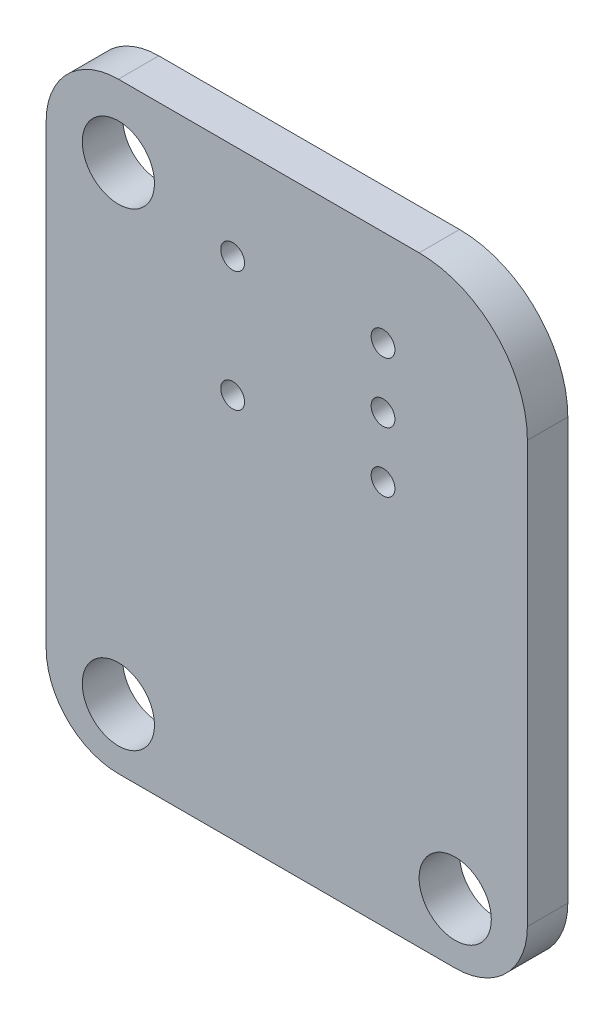
ISO-10303-21;
HEADER;
FILE_DESCRIPTION(('STEP AP214'),'2;1');
FILE_NAME('part.step','',(''),(''),'','','');
FILE_SCHEMA(('AUTOMOTIVE_DESIGN { 1 0 10303 214 1 1 1 1 }'));
ENDSEC;
DATA;
#1=APPLICATION_CONTEXT('core data for automotive mechanical design processes');
#2=APPLICATION_PROTOCOL_DEFINITION('international standard','automotive_design',2000,#1);
#3=PRODUCT_CONTEXT('',#1,'mechanical');
#4=PRODUCT('Part','Part','',(#3));
#5=PRODUCT_RELATED_PRODUCT_CATEGORY('part','',(#4));
#6=PRODUCT_DEFINITION_FORMATION('','',#4);
#7=PRODUCT_DEFINITION_CONTEXT('part definition',#1,'design');
#8=PRODUCT_DEFINITION('design','',#6,#7);
#9=PRODUCT_DEFINITION_SHAPE('','',#8);
#10=(LENGTH_UNIT() NAMED_UNIT(*) SI_UNIT(.MILLI.,.METRE.));
#11=(NAMED_UNIT(*) PLANE_ANGLE_UNIT() SI_UNIT($,.RADIAN.));
#12=(NAMED_UNIT(*) SI_UNIT($,.STERADIAN.) SOLID_ANGLE_UNIT());
#13=UNCERTAINTY_MEASURE_WITH_UNIT(LENGTH_MEASURE(1.E-05),#10,'distance_accuracy_value','');
#14=(GEOMETRIC_REPRESENTATION_CONTEXT(3) GLOBAL_UNCERTAINTY_ASSIGNED_CONTEXT((#13)) GLOBAL_UNIT_ASSIGNED_CONTEXT((#10,
#11,#12)) REPRESENTATION_CONTEXT('',''));
#15=CARTESIAN_POINT('',(0.,0.,0.));
#16=DIRECTION('',(0.,0.,1.));
#17=DIRECTION('',(1.,0.,0.));
#18=AXIS2_PLACEMENT_3D('',#15,#16,#17);
#19=CARTESIAN_POINT('',(95.5,60.5,-3.02000000000003));
#20=DIRECTION('',(0.,0.,-1.));
#21=DIRECTION('',(-1.,0.,0.));
#22=AXIS2_PLACEMENT_3D('',#19,#20,#21);
#23=CYLINDRICAL_SURFACE('',#22,4.50000000000003);
#24=CARTESIAN_POINT('',(95.5,60.5,-4.70000000000003));
#25=DIRECTION('',(0.,0.,1.));
#26=DIRECTION('',(1.,0.,0.));
#27=AXIS2_PLACEMENT_3D('',#24,#25,#26);
#28=CIRCLE('',#27,4.50000000000003);
#29=CARTESIAN_POINT('',(100.,60.5,-4.70000000000003));
#30=VERTEX_POINT('',#29);
#31=CARTESIAN_POINT('',(95.5,65.,-4.70000000000003));
#32=VERTEX_POINT('',#31);
#33=EDGE_CURVE('E129',#30,#32,#28,.T.);
#34=ORIENTED_EDGE('',*,*,#33,.T.);
#35=DIRECTION('',(0.,0.,-1.));
#36=VECTOR('',#35,1.);
#37=CARTESIAN_POINT('',(95.5,65.,-3.02000000000003));
#38=LINE('',#37,#36);
#39=CARTESIAN_POINT('',(95.5,65.,-3.02000000000003));
#40=VERTEX_POINT('',#39);
#41=EDGE_CURVE('E11',#40,#32,#38,.T.);
#42=ORIENTED_EDGE('',*,*,#41,.F.);
#43=CARTESIAN_POINT('',(95.5,60.5,-3.02000000000003));
#44=DIRECTION('',(0.,0.,1.));
#45=DIRECTION('',(1.,0.,0.));
#46=AXIS2_PLACEMENT_3D('',#43,#44,#45);
#47=CIRCLE('',#46,4.50000000000003);
#48=CARTESIAN_POINT('',(100.,60.5,-3.02000000000003));
#49=VERTEX_POINT('',#48);
#50=EDGE_CURVE('E144',#49,#40,#47,.T.);
#51=ORIENTED_EDGE('',*,*,#50,.F.);
#52=DIRECTION('',(0.,0.,-1.));
#53=VECTOR('',#52,1.);
#54=CARTESIAN_POINT('',(100.,60.5,-3.02000000000003));
#55=LINE('',#54,#53);
#56=EDGE_CURVE('E125',#49,#30,#55,.T.);
#57=ORIENTED_EDGE('',*,*,#56,.T.);
#58=EDGE_LOOP('',(#34,#42,#51,#57));
#59=FACE_BOUND('',#58,.T.);
#60=ADVANCED_FACE('F33',(#59),#23,.T.);
#61=CARTESIAN_POINT('',(95.5,65.,-3.02000000000003));
#62=DIRECTION('',(0.,-1.,0.));
#63=DIRECTION('',(1.,0.,0.));
#64=AXIS2_PLACEMENT_3D('',#61,#62,#63);
#65=PLANE('',#64);
#66=DIRECTION('',(-1.,0.,0.));
#67=VECTOR('',#66,1.);
#68=CARTESIAN_POINT('',(95.5,65.,-4.70000000000003));
#69=LINE('',#68,#67);
#70=CARTESIAN_POINT('',(83.,65.,-4.70000000000003));
#71=VERTEX_POINT('',#70);
#72=EDGE_CURVE('E132',#32,#71,#69,.T.);
#73=ORIENTED_EDGE('',*,*,#72,.T.);
#74=DIRECTION('',(0.,0.,-1.));
#75=VECTOR('',#74,1.);
#76=CARTESIAN_POINT('',(83.,65.,-3.02000000000003));
#77=LINE('',#76,#75);
#78=CARTESIAN_POINT('',(83.,65.,-3.02000000000003));
#79=VERTEX_POINT('',#78);
#80=EDGE_CURVE('E41',#79,#71,#77,.T.);
#81=ORIENTED_EDGE('',*,*,#80,.F.);
#82=DIRECTION('',(-1.,0.,0.));
#83=VECTOR('',#82,1.);
#84=CARTESIAN_POINT('',(95.5,65.,-3.02000000000003));
#85=LINE('',#84,#83);
#86=EDGE_CURVE('E92',#40,#79,#85,.T.);
#87=ORIENTED_EDGE('',*,*,#86,.F.);
#88=ORIENTED_EDGE('',*,*,#41,.T.);
#89=EDGE_LOOP('',(#73,#81,#87,#88));
#90=FACE_BOUND('',#89,.T.);
#91=ADVANCED_FACE('F239',(#90),#65,.F.);
#92=CARTESIAN_POINT('',(83.,62.,-3.02000000000003));
#93=DIRECTION('',(0.,0.,-1.));
#94=DIRECTION('',(-1.,0.,0.));
#95=AXIS2_PLACEMENT_3D('',#92,#93,#94);
#96=CYLINDRICAL_SURFACE('',#95,3.00000000000001);
#97=CARTESIAN_POINT('',(83.,62.,-4.70000000000003));
#98=DIRECTION('',(0.,0.,1.));
#99=DIRECTION('',(1.,0.,0.));
#100=AXIS2_PLACEMENT_3D('',#97,#98,#99);
#101=CIRCLE('',#100,3.00000000000001);
#102=CARTESIAN_POINT('',(80.,62.,-4.70000000000003));
#103=VERTEX_POINT('',#102);
#104=EDGE_CURVE('E135',#71,#103,#101,.T.);
#105=ORIENTED_EDGE('',*,*,#104,.T.);
#106=DIRECTION('',(0.,0.,-1.));
#107=VECTOR('',#106,1.);
#108=CARTESIAN_POINT('',(80.,62.,-3.02000000000003));
#109=LINE('',#108,#107);
#110=CARTESIAN_POINT('',(80.,62.,-3.02000000000003));
#111=VERTEX_POINT('',#110);
#112=EDGE_CURVE('E151',#111,#103,#109,.T.);
#113=ORIENTED_EDGE('',*,*,#112,.F.);
#114=CARTESIAN_POINT('',(83.,62.,-3.02000000000003));
#115=DIRECTION('',(0.,0.,1.));
#116=DIRECTION('',(1.,0.,0.));
#117=AXIS2_PLACEMENT_3D('',#114,#115,#116);
#118=CIRCLE('',#117,3.00000000000001);
#119=EDGE_CURVE('E159',#79,#111,#118,.T.);
#120=ORIENTED_EDGE('',*,*,#119,.F.);
#121=ORIENTED_EDGE('',*,*,#80,.T.);
#122=EDGE_LOOP('',(#105,#113,#120,#121));
#123=FACE_BOUND('',#122,.T.);
#124=ADVANCED_FACE('F157',(#123),#96,.T.);
#125=CARTESIAN_POINT('',(80.,43.,-3.02000000000003));
#126=DIRECTION('',(1.,0.,0.));
#127=DIRECTION('',(0.,1.,0.));
#128=AXIS2_PLACEMENT_3D('',#125,#126,#127);
#129=PLANE('',#128);
#130=DIRECTION('',(0.,-1.,0.));
#131=VECTOR('',#130,1.);
#132=CARTESIAN_POINT('',(80.,43.,-4.70000000000003));
#133=LINE('',#132,#131);
#134=CARTESIAN_POINT('',(80.,43.,-4.70000000000003));
#135=VERTEX_POINT('',#134);
#136=EDGE_CURVE('E137',#103,#135,#133,.T.);
#137=ORIENTED_EDGE('',*,*,#136,.T.);
#138=DIRECTION('',(0.,0.,-1.));
#139=VECTOR('',#138,1.);
#140=CARTESIAN_POINT('',(80.,43.,-3.02000000000003));
#141=LINE('',#140,#139);
#142=CARTESIAN_POINT('',(80.,43.,-3.02000000000003));
#143=VERTEX_POINT('',#142);
#144=EDGE_CURVE('E148',#143,#135,#141,.T.);
#145=ORIENTED_EDGE('',*,*,#144,.F.);
#146=DIRECTION('',(0.,-1.,0.));
#147=VECTOR('',#146,1.);
#148=CARTESIAN_POINT('',(80.,43.,-3.02000000000003));
#149=LINE('',#148,#147);
#150=EDGE_CURVE('E171',#111,#143,#149,.T.);
#151=ORIENTED_EDGE('',*,*,#150,.F.);
#152=ORIENTED_EDGE('',*,*,#112,.T.);
#153=EDGE_LOOP('',(#137,#145,#151,#152));
#154=FACE_BOUND('',#153,.T.);
#155=ADVANCED_FACE('F167',(#154),#129,.F.);
#156=CARTESIAN_POINT('',(83.,43.,-3.02000000000003));
#157=DIRECTION('',(0.,0.,-1.));
#158=DIRECTION('',(-1.,0.,0.));
#159=AXIS2_PLACEMENT_3D('',#156,#157,#158);
#160=CYLINDRICAL_SURFACE('',#159,3.);
#161=CARTESIAN_POINT('',(83.,43.,-4.70000000000003));
#162=DIRECTION('',(0.,0.,1.));
#163=DIRECTION('',(-1.,0.,0.));
#164=AXIS2_PLACEMENT_3D('',#161,#162,#163);
#165=CIRCLE('',#164,3.);
#166=CARTESIAN_POINT('',(83.,40.,-4.70000000000003));
#167=VERTEX_POINT('',#166);
#168=EDGE_CURVE('E139',#135,#167,#165,.T.);
#169=ORIENTED_EDGE('',*,*,#168,.T.);
#170=DIRECTION('',(0.,0.,-1.));
#171=VECTOR('',#170,1.);
#172=CARTESIAN_POINT('',(83.,40.,-3.02000000000003));
#173=LINE('',#172,#171);
#174=CARTESIAN_POINT('',(83.,40.,-3.02000000000003));
#175=VERTEX_POINT('',#174);
#176=EDGE_CURVE('E120',#175,#167,#173,.T.);
#177=ORIENTED_EDGE('',*,*,#176,.F.);
#178=CARTESIAN_POINT('',(83.,43.,-3.02000000000003));
#179=DIRECTION('',(0.,0.,1.));
#180=DIRECTION('',(-1.,0.,0.));
#181=AXIS2_PLACEMENT_3D('',#178,#179,#180);
#182=CIRCLE('',#181,3.);
#183=EDGE_CURVE('E111',#143,#175,#182,.T.);
#184=ORIENTED_EDGE('',*,*,#183,.F.);
#185=ORIENTED_EDGE('',*,*,#144,.T.);
#186=EDGE_LOOP('',(#169,#177,#184,#185));
#187=FACE_BOUND('',#186,.T.);
#188=ADVANCED_FACE('F170',(#187),#160,.T.);
#189=CARTESIAN_POINT('',(97.,40.,-3.02000000000003));
#190=DIRECTION('',(0.,1.,0.));
#191=DIRECTION('',(0.,0.,1.));
#192=AXIS2_PLACEMENT_3D('',#189,#190,#191);
#193=PLANE('',#192);
#194=DIRECTION('',(1.,0.,0.));
#195=VECTOR('',#194,1.);
#196=CARTESIAN_POINT('',(97.,40.,-4.70000000000003));
#197=LINE('',#196,#195);
#198=CARTESIAN_POINT('',(97.,40.,-4.70000000000003));
#199=VERTEX_POINT('',#198);
#200=EDGE_CURVE('E119',#167,#199,#197,.T.);
#201=ORIENTED_EDGE('',*,*,#200,.T.);
#202=DIRECTION('',(0.,0.,-1.));
#203=VECTOR('',#202,1.);
#204=CARTESIAN_POINT('',(97.,40.,-3.02000000000003));
#205=LINE('',#204,#203);
#206=CARTESIAN_POINT('',(97.,40.,-3.02000000000003));
#207=VERTEX_POINT('',#206);
#208=EDGE_CURVE('E116',#207,#199,#205,.T.);
#209=ORIENTED_EDGE('',*,*,#208,.F.);
#210=DIRECTION('',(1.,0.,0.));
#211=VECTOR('',#210,1.);
#212=CARTESIAN_POINT('',(97.,40.,-3.02000000000003));
#213=LINE('',#212,#211);
#214=EDGE_CURVE('E105',#175,#207,#213,.T.);
#215=ORIENTED_EDGE('',*,*,#214,.F.);
#216=ORIENTED_EDGE('',*,*,#176,.T.);
#217=EDGE_LOOP('',(#201,#209,#215,#216));
#218=FACE_BOUND('',#217,.T.);
#219=ADVANCED_FACE('F117',(#218),#193,.F.);
#220=CARTESIAN_POINT('',(97.,43.,-3.02000000000003));
#221=DIRECTION('',(0.,0.,-1.));
#222=DIRECTION('',(-1.,0.,0.));
#223=AXIS2_PLACEMENT_3D('',#220,#221,#222);
#224=CYLINDRICAL_SURFACE('',#223,3.00000000000001);
#225=CARTESIAN_POINT('',(97.,43.,-4.70000000000003));
#226=DIRECTION('',(0.,0.,1.));
#227=DIRECTION('',(1.,0.,0.));
#228=AXIS2_PLACEMENT_3D('',#225,#226,#227);
#229=CIRCLE('',#228,3.00000000000001);
#230=CARTESIAN_POINT('',(100.,43.,-4.70000000000003));
#231=VERTEX_POINT('',#230);
#232=EDGE_CURVE('E78',#199,#231,#229,.T.);
#233=ORIENTED_EDGE('',*,*,#232,.T.);
#234=DIRECTION('',(0.,0.,-1.));
#235=VECTOR('',#234,1.);
#236=CARTESIAN_POINT('',(100.,43.,-3.02000000000003));
#237=LINE('',#236,#235);
#238=CARTESIAN_POINT('',(100.,43.,-3.02000000000003));
#239=VERTEX_POINT('',#238);
#240=EDGE_CURVE('E121',#239,#231,#237,.T.);
#241=ORIENTED_EDGE('',*,*,#240,.F.);
#242=CARTESIAN_POINT('',(97.,43.,-3.02000000000003));
#243=DIRECTION('',(0.,0.,1.));
#244=DIRECTION('',(1.,0.,0.));
#245=AXIS2_PLACEMENT_3D('',#242,#243,#244);
#246=CIRCLE('',#245,3.00000000000001);
#247=EDGE_CURVE('E109',#207,#239,#246,.T.);
#248=ORIENTED_EDGE('',*,*,#247,.F.);
#249=ORIENTED_EDGE('',*,*,#208,.T.);
#250=EDGE_LOOP('',(#233,#241,#248,#249));
#251=FACE_BOUND('',#250,.T.);
#252=ADVANCED_FACE('F123',(#251),#224,.T.);
#253=CARTESIAN_POINT('',(100.,43.,-3.02000000000003));
#254=DIRECTION('',(-1.,0.,0.));
#255=DIRECTION('',(0.,-1.,0.));
#256=AXIS2_PLACEMENT_3D('',#253,#254,#255);
#257=PLANE('',#256);
#258=DIRECTION('',(0.,1.,0.));
#259=VECTOR('',#258,1.);
#260=CARTESIAN_POINT('',(100.,43.,-4.70000000000003));
#261=LINE('',#260,#259);
#262=EDGE_CURVE('E84',#231,#30,#261,.T.);
#263=ORIENTED_EDGE('',*,*,#262,.T.);
#264=ORIENTED_EDGE('',*,*,#56,.F.);
#265=DIRECTION('',(0.,1.,0.));
#266=VECTOR('',#265,1.);
#267=CARTESIAN_POINT('',(100.,43.,-3.02000000000003));
#268=LINE('',#267,#266);
#269=EDGE_CURVE('E49',#239,#49,#268,.T.);
#270=ORIENTED_EDGE('',*,*,#269,.F.);
#271=ORIENTED_EDGE('',*,*,#240,.T.);
#272=EDGE_LOOP('',(#263,#264,#270,#271));
#273=FACE_BOUND('',#272,.T.);
#274=ADVANCED_FACE('F246',(#273),#257,.F.);
#275=CARTESIAN_POINT('',(95.5,60.5,-3.02000000000003));
#276=DIRECTION('',(0.,0.,1.));
#277=DIRECTION('',(1.,0.,0.));
#278=AXIS2_PLACEMENT_3D('',#275,#276,#277);
#279=PLANE('',#278);
#280=CARTESIAN_POINT('',(94.0000000108,60.9999999962,-3.02000000000003));
#281=DIRECTION('',(0.,0.,1.));
#282=DIRECTION('',(1.,0.,0.));
#283=AXIS2_PLACEMENT_3D('',#280,#281,#282);
#284=CIRCLE('',#283,0.495300000000004);
#285=CARTESIAN_POINT('',(94.4953000108,60.9999999962,-3.02000000000003));
#286=VERTEX_POINT('',#285);
#287=EDGE_CURVE('E218',#286,#286,#284,.T.);
#288=ORIENTED_EDGE('',*,*,#287,.F.);
#289=EDGE_LOOP('',(#288));
#290=FACE_BOUND('',#289,.T.);
#291=CARTESIAN_POINT('',(94.0000000108,55.9999999886,-3.02000000000003));
#292=DIRECTION('',(0.,0.,1.));
#293=DIRECTION('',(1.,0.,0.));
#294=AXIS2_PLACEMENT_3D('',#291,#292,#293);
#295=CIRCLE('',#294,0.495300000000004);
#296=CARTESIAN_POINT('',(94.4953000108,55.9999999886,-3.02000000000003));
#297=VERTEX_POINT('',#296);
#298=EDGE_CURVE('E212',#297,#297,#295,.T.);
#299=ORIENTED_EDGE('',*,*,#298,.F.);
#300=EDGE_LOOP('',(#299));
#301=FACE_BOUND('',#300,.T.);
#302=CARTESIAN_POINT('',(94.0000000108,58.4999999924,-3.02000000000003));
#303=DIRECTION('',(0.,0.,1.));
#304=DIRECTION('',(1.,0.,0.));
#305=AXIS2_PLACEMENT_3D('',#302,#303,#304);
#306=CIRCLE('',#305,0.495300000000004);
#307=CARTESIAN_POINT('',(94.4953000108,58.4999999924,-3.02000000000003));
#308=VERTEX_POINT('',#307);
#309=EDGE_CURVE('E206',#308,#308,#306,.T.);
#310=ORIENTED_EDGE('',*,*,#309,.F.);
#311=EDGE_LOOP('',(#310));
#312=FACE_BOUND('',#311,.T.);
#313=CARTESIAN_POINT('',(87.7499999886,60.9999999962,-3.02000000000003));
#314=DIRECTION('',(0.,0.,1.));
#315=DIRECTION('',(1.,0.,0.));
#316=AXIS2_PLACEMENT_3D('',#313,#314,#315);
#317=CIRCLE('',#316,0.495300000000004);
#318=CARTESIAN_POINT('',(88.2452999886,60.9999999962,-3.02000000000003));
#319=VERTEX_POINT('',#318);
#320=EDGE_CURVE('E200',#319,#319,#317,.T.);
#321=ORIENTED_EDGE('',*,*,#320,.F.);
#322=EDGE_LOOP('',(#321));
#323=FACE_BOUND('',#322,.T.);
#324=CARTESIAN_POINT('',(87.7499999886,55.9999999886,-3.02000000000003));
#325=DIRECTION('',(0.,0.,1.));
#326=DIRECTION('',(1.,0.,0.));
#327=AXIS2_PLACEMENT_3D('',#324,#325,#326);
#328=CIRCLE('',#327,0.495300000000004);
#329=CARTESIAN_POINT('',(88.2452999886,55.9999999886,-3.02000000000003));
#330=VERTEX_POINT('',#329);
#331=EDGE_CURVE('E194',#330,#330,#328,.T.);
#332=ORIENTED_EDGE('',*,*,#331,.F.);
#333=EDGE_LOOP('',(#332));
#334=FACE_BOUND('',#333,.T.);
#335=CARTESIAN_POINT('',(83.,62.,-3.02000000000003));
#336=DIRECTION('',(0.,0.,1.));
#337=DIRECTION('',(1.,0.,0.));
#338=AXIS2_PLACEMENT_3D('',#335,#336,#337);
#339=CIRCLE('',#338,1.5);
#340=CARTESIAN_POINT('',(84.5,62.,-3.02000000000003));
#341=VERTEX_POINT('',#340);
#342=EDGE_CURVE('E188',#341,#341,#339,.T.);
#343=ORIENTED_EDGE('',*,*,#342,.F.);
#344=EDGE_LOOP('',(#343));
#345=FACE_BOUND('',#344,.T.);
#346=CARTESIAN_POINT('',(97.,42.5,-3.02000000000003));
#347=DIRECTION('',(0.,0.,1.));
#348=DIRECTION('',(1.,0.,0.));
#349=AXIS2_PLACEMENT_3D('',#346,#347,#348);
#350=CIRCLE('',#349,1.5);
#351=CARTESIAN_POINT('',(98.5,42.5,-3.02000000000003));
#352=VERTEX_POINT('',#351);
#353=EDGE_CURVE('E182',#352,#352,#350,.T.);
#354=ORIENTED_EDGE('',*,*,#353,.F.);
#355=EDGE_LOOP('',(#354));
#356=FACE_BOUND('',#355,.T.);
#357=CARTESIAN_POINT('',(83.,42.5,-3.02000000000003));
#358=DIRECTION('',(0.,0.,1.));
#359=DIRECTION('',(1.,0.,0.));
#360=AXIS2_PLACEMENT_3D('',#357,#358,#359);
#361=CIRCLE('',#360,1.5);
#362=CARTESIAN_POINT('',(84.5,42.5,-3.02000000000003));
#363=VERTEX_POINT('',#362);
#364=EDGE_CURVE('E133',#363,#363,#361,.T.);
#365=ORIENTED_EDGE('',*,*,#364,.F.);
#366=EDGE_LOOP('',(#365));
#367=FACE_BOUND('',#366,.T.);
#368=ORIENTED_EDGE('',*,*,#50,.T.);
#369=ORIENTED_EDGE('',*,*,#86,.T.);
#370=ORIENTED_EDGE('',*,*,#119,.T.);
#371=ORIENTED_EDGE('',*,*,#150,.T.);
#372=ORIENTED_EDGE('',*,*,#183,.T.);
#373=ORIENTED_EDGE('',*,*,#214,.T.);
#374=ORIENTED_EDGE('',*,*,#247,.T.);
#375=ORIENTED_EDGE('',*,*,#269,.T.);
#376=EDGE_LOOP('',(#368,#369,#370,#371,#372,#373,#374,#375));
#377=FACE_BOUND('',#376,.T.);
#378=ADVANCED_FACE('F107',(#290,#301,#312,#323,#334,#345,#356,#367,#377),#279,.T.);
#379=CARTESIAN_POINT('',(95.5,60.5,-4.70000000000003));
#380=DIRECTION('',(0.,0.,1.));
#381=DIRECTION('',(1.,0.,0.));
#382=AXIS2_PLACEMENT_3D('',#379,#380,#381);
#383=PLANE('',#382);
#384=CARTESIAN_POINT('',(94.0000000108,60.9999999962,-4.70000000000003));
#385=DIRECTION('',(0.,0.,1.));
#386=DIRECTION('',(1.,0.,0.));
#387=AXIS2_PLACEMENT_3D('',#384,#385,#386);
#388=CIRCLE('',#387,0.495300000000004);
#389=CARTESIAN_POINT('',(94.4953000108,60.9999999962,-4.70000000000003));
#390=VERTEX_POINT('',#389);
#391=EDGE_CURVE('E221',#390,#390,#388,.T.);
#392=ORIENTED_EDGE('',*,*,#391,.T.);
#393=EDGE_LOOP('',(#392));
#394=FACE_BOUND('',#393,.T.);
#395=CARTESIAN_POINT('',(94.0000000108,55.9999999886,-4.70000000000003));
#396=DIRECTION('',(0.,0.,1.));
#397=DIRECTION('',(1.,0.,0.));
#398=AXIS2_PLACEMENT_3D('',#395,#396,#397);
#399=CIRCLE('',#398,0.495300000000004);
#400=CARTESIAN_POINT('',(94.4953000108,55.9999999886,-4.70000000000003));
#401=VERTEX_POINT('',#400);
#402=EDGE_CURVE('E215',#401,#401,#399,.T.);
#403=ORIENTED_EDGE('',*,*,#402,.T.);
#404=EDGE_LOOP('',(#403));
#405=FACE_BOUND('',#404,.T.);
#406=CARTESIAN_POINT('',(94.0000000108,58.4999999924,-4.70000000000003));
#407=DIRECTION('',(0.,0.,1.));
#408=DIRECTION('',(1.,0.,0.));
#409=AXIS2_PLACEMENT_3D('',#406,#407,#408);
#410=CIRCLE('',#409,0.495300000000004);
#411=CARTESIAN_POINT('',(94.4953000108,58.4999999924,-4.70000000000003));
#412=VERTEX_POINT('',#411);
#413=EDGE_CURVE('E209',#412,#412,#410,.T.);
#414=ORIENTED_EDGE('',*,*,#413,.T.);
#415=EDGE_LOOP('',(#414));
#416=FACE_BOUND('',#415,.T.);
#417=CARTESIAN_POINT('',(87.7499999886,60.9999999962,-4.70000000000003));
#418=DIRECTION('',(0.,0.,1.));
#419=DIRECTION('',(1.,0.,0.));
#420=AXIS2_PLACEMENT_3D('',#417,#418,#419);
#421=CIRCLE('',#420,0.495300000000004);
#422=CARTESIAN_POINT('',(88.2452999886,60.9999999962,-4.70000000000003));
#423=VERTEX_POINT('',#422);
#424=EDGE_CURVE('E203',#423,#423,#421,.T.);
#425=ORIENTED_EDGE('',*,*,#424,.T.);
#426=EDGE_LOOP('',(#425));
#427=FACE_BOUND('',#426,.T.);
#428=CARTESIAN_POINT('',(87.7499999886,55.9999999886,-4.70000000000003));
#429=DIRECTION('',(0.,0.,1.));
#430=DIRECTION('',(1.,0.,0.));
#431=AXIS2_PLACEMENT_3D('',#428,#429,#430);
#432=CIRCLE('',#431,0.495300000000004);
#433=CARTESIAN_POINT('',(88.2452999886,55.9999999886,-4.70000000000003));
#434=VERTEX_POINT('',#433);
#435=EDGE_CURVE('E197',#434,#434,#432,.T.);
#436=ORIENTED_EDGE('',*,*,#435,.T.);
#437=EDGE_LOOP('',(#436));
#438=FACE_BOUND('',#437,.T.);
#439=CARTESIAN_POINT('',(83.,62.,-4.70000000000003));
#440=DIRECTION('',(0.,0.,1.));
#441=DIRECTION('',(1.,0.,0.));
#442=AXIS2_PLACEMENT_3D('',#439,#440,#441);
#443=CIRCLE('',#442,1.5);
#444=CARTESIAN_POINT('',(84.5,62.,-4.70000000000003));
#445=VERTEX_POINT('',#444);
#446=EDGE_CURVE('E191',#445,#445,#443,.T.);
#447=ORIENTED_EDGE('',*,*,#446,.T.);
#448=EDGE_LOOP('',(#447));
#449=FACE_BOUND('',#448,.T.);
#450=CARTESIAN_POINT('',(97.,42.5,-4.70000000000003));
#451=DIRECTION('',(0.,0.,1.));
#452=DIRECTION('',(1.,0.,0.));
#453=AXIS2_PLACEMENT_3D('',#450,#451,#452);
#454=CIRCLE('',#453,1.5);
#455=CARTESIAN_POINT('',(98.5,42.5,-4.70000000000003));
#456=VERTEX_POINT('',#455);
#457=EDGE_CURVE('E185',#456,#456,#454,.T.);
#458=ORIENTED_EDGE('',*,*,#457,.T.);
#459=EDGE_LOOP('',(#458));
#460=FACE_BOUND('',#459,.T.);
#461=CARTESIAN_POINT('',(83.,42.5,-4.70000000000003));
#462=DIRECTION('',(0.,0.,1.));
#463=DIRECTION('',(1.,0.,0.));
#464=AXIS2_PLACEMENT_3D('',#461,#462,#463);
#465=CIRCLE('',#464,1.5);
#466=CARTESIAN_POINT('',(84.5,42.5,-4.70000000000003));
#467=VERTEX_POINT('',#466);
#468=EDGE_CURVE('E179',#467,#467,#465,.T.);
#469=ORIENTED_EDGE('',*,*,#468,.T.);
#470=EDGE_LOOP('',(#469));
#471=FACE_BOUND('',#470,.T.);
#472=ORIENTED_EDGE('',*,*,#33,.F.);
#473=ORIENTED_EDGE('',*,*,#262,.F.);
#474=ORIENTED_EDGE('',*,*,#232,.F.);
#475=ORIENTED_EDGE('',*,*,#200,.F.);
#476=ORIENTED_EDGE('',*,*,#168,.F.);
#477=ORIENTED_EDGE('',*,*,#136,.F.);
#478=ORIENTED_EDGE('',*,*,#104,.F.);
#479=ORIENTED_EDGE('',*,*,#72,.F.);
#480=EDGE_LOOP('',(#472,#473,#474,#475,#476,#477,#478,#479));
#481=FACE_BOUND('',#480,.T.);
#482=ADVANCED_FACE('F163',(#394,#405,#416,#427,#438,#449,#460,#471,#481),#383,.F.);
#483=CARTESIAN_POINT('',(83.,42.5,-4.70000000000003));
#484=DIRECTION('',(0.,0.,1.));
#485=DIRECTION('',(1.,0.,0.));
#486=AXIS2_PLACEMENT_3D('',#483,#484,#485);
#487=CYLINDRICAL_SURFACE('',#486,1.5);
#488=ORIENTED_EDGE('',*,*,#364,.T.);
#489=EDGE_LOOP('',(#488));
#490=FACE_BOUND('',#489,.T.);
#491=ORIENTED_EDGE('',*,*,#468,.F.);
#492=EDGE_LOOP('',(#491));
#493=FACE_BOUND('',#492,.T.);
#494=ADVANCED_FACE('F304',(#490,#493),#487,.F.);
#495=CARTESIAN_POINT('',(97.,42.5,-4.70000000000003));
#496=DIRECTION('',(0.,0.,1.));
#497=DIRECTION('',(1.,0.,0.));
#498=AXIS2_PLACEMENT_3D('',#495,#496,#497);
#499=CYLINDRICAL_SURFACE('',#498,1.5);
#500=ORIENTED_EDGE('',*,*,#353,.T.);
#501=EDGE_LOOP('',(#500));
#502=FACE_BOUND('',#501,.T.);
#503=ORIENTED_EDGE('',*,*,#457,.F.);
#504=EDGE_LOOP('',(#503));
#505=FACE_BOUND('',#504,.T.);
#506=ADVANCED_FACE('F312',(#502,#505),#499,.F.);
#507=CARTESIAN_POINT('',(83.,62.,-4.70000000000003));
#508=DIRECTION('',(0.,0.,1.));
#509=DIRECTION('',(1.,0.,0.));
#510=AXIS2_PLACEMENT_3D('',#507,#508,#509);
#511=CYLINDRICAL_SURFACE('',#510,1.5);
#512=ORIENTED_EDGE('',*,*,#342,.T.);
#513=EDGE_LOOP('',(#512));
#514=FACE_BOUND('',#513,.T.);
#515=ORIENTED_EDGE('',*,*,#446,.F.);
#516=EDGE_LOOP('',(#515));
#517=FACE_BOUND('',#516,.T.);
#518=ADVANCED_FACE('F322',(#514,#517),#511,.F.);
#519=CARTESIAN_POINT('',(87.7499999886,55.9999999886,-4.70000000000003));
#520=DIRECTION('',(0.,0.,1.));
#521=DIRECTION('',(1.,0.,0.));
#522=AXIS2_PLACEMENT_3D('',#519,#520,#521);
#523=CYLINDRICAL_SURFACE('',#522,0.495300000000004);
#524=ORIENTED_EDGE('',*,*,#331,.T.);
#525=EDGE_LOOP('',(#524));
#526=FACE_BOUND('',#525,.T.);
#527=ORIENTED_EDGE('',*,*,#435,.F.);
#528=EDGE_LOOP('',(#527));
#529=FACE_BOUND('',#528,.T.);
#530=ADVANCED_FACE('F332',(#526,#529),#523,.F.);
#531=CARTESIAN_POINT('',(87.7499999886,60.9999999962,-4.70000000000003));
#532=DIRECTION('',(0.,0.,1.));
#533=DIRECTION('',(1.,0.,0.));
#534=AXIS2_PLACEMENT_3D('',#531,#532,#533);
#535=CYLINDRICAL_SURFACE('',#534,0.495300000000004);
#536=ORIENTED_EDGE('',*,*,#320,.T.);
#537=EDGE_LOOP('',(#536));
#538=FACE_BOUND('',#537,.T.);
#539=ORIENTED_EDGE('',*,*,#424,.F.);
#540=EDGE_LOOP('',(#539));
#541=FACE_BOUND('',#540,.T.);
#542=ADVANCED_FACE('F342',(#538,#541),#535,.F.);
#543=CARTESIAN_POINT('',(94.0000000108,58.4999999924,-4.70000000000003));
#544=DIRECTION('',(0.,0.,1.));
#545=DIRECTION('',(1.,0.,0.));
#546=AXIS2_PLACEMENT_3D('',#543,#544,#545);
#547=CYLINDRICAL_SURFACE('',#546,0.495300000000004);
#548=ORIENTED_EDGE('',*,*,#309,.T.);
#549=EDGE_LOOP('',(#548));
#550=FACE_BOUND('',#549,.T.);
#551=ORIENTED_EDGE('',*,*,#413,.F.);
#552=EDGE_LOOP('',(#551));
#553=FACE_BOUND('',#552,.T.);
#554=ADVANCED_FACE('F235',(#550,#553),#547,.F.);
#555=CARTESIAN_POINT('',(94.0000000108,55.9999999886,-4.70000000000003));
#556=DIRECTION('',(0.,0.,1.));
#557=DIRECTION('',(1.,0.,0.));
#558=AXIS2_PLACEMENT_3D('',#555,#556,#557);
#559=CYLINDRICAL_SURFACE('',#558,0.495300000000004);
#560=ORIENTED_EDGE('',*,*,#298,.T.);
#561=EDGE_LOOP('',(#560));
#562=FACE_BOUND('',#561,.T.);
#563=ORIENTED_EDGE('',*,*,#402,.F.);
#564=EDGE_LOOP('',(#563));
#565=FACE_BOUND('',#564,.T.);
#566=ADVANCED_FACE('F229',(#562,#565),#559,.F.);
#567=CARTESIAN_POINT('',(94.0000000108,60.9999999962,-4.70000000000003));
#568=DIRECTION('',(0.,0.,1.));
#569=DIRECTION('',(1.,0.,0.));
#570=AXIS2_PLACEMENT_3D('',#567,#568,#569);
#571=CYLINDRICAL_SURFACE('',#570,0.495300000000004);
#572=ORIENTED_EDGE('',*,*,#287,.T.);
#573=EDGE_LOOP('',(#572));
#574=FACE_BOUND('',#573,.T.);
#575=ORIENTED_EDGE('',*,*,#391,.F.);
#576=EDGE_LOOP('',(#575));
#577=FACE_BOUND('',#576,.T.);
#578=ADVANCED_FACE('F227',(#574,#577),#571,.F.);
#579=CLOSED_SHELL('',(#60,#91,#124,#155,#188,#219,#252,#274,#378,#482,#494,#506,#518,#530,#542,
#554,#566,#578));
#580=MANIFOLD_SOLID_BREP('B2',#579);
#581=ADVANCED_BREP_SHAPE_REPRESENTATION('',(#18,#580),#14);
#582=SHAPE_DEFINITION_REPRESENTATION(#9,#581);
ENDSEC;
END-ISO-10303-21;
